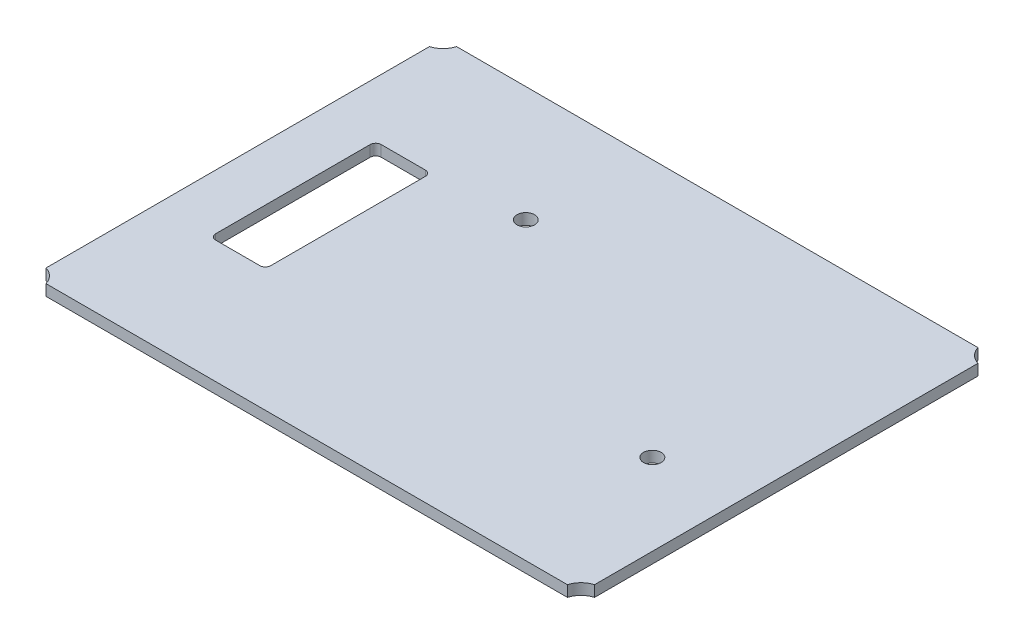
ISO-10303-21;
HEADER;
FILE_DESCRIPTION(('STEP AP214'),'2;1');
FILE_NAME('part.step','',(''),(''),'','','');
FILE_SCHEMA(('AUTOMOTIVE_DESIGN { 1 0 10303 214 1 1 1 1 }'));
ENDSEC;
DATA;
#1=APPLICATION_CONTEXT('core data for automotive mechanical design processes');
#2=APPLICATION_PROTOCOL_DEFINITION('international standard','automotive_design',2000,#1);
#3=PRODUCT_CONTEXT('',#1,'mechanical');
#4=PRODUCT('Part','Part','',(#3));
#5=PRODUCT_RELATED_PRODUCT_CATEGORY('part','',(#4));
#6=PRODUCT_DEFINITION_FORMATION('','',#4);
#7=PRODUCT_DEFINITION_CONTEXT('part definition',#1,'design');
#8=PRODUCT_DEFINITION('design','',#6,#7);
#9=PRODUCT_DEFINITION_SHAPE('','',#8);
#10=(LENGTH_UNIT() NAMED_UNIT(*) SI_UNIT(.MILLI.,.METRE.));
#11=(NAMED_UNIT(*) PLANE_ANGLE_UNIT() SI_UNIT($,.RADIAN.));
#12=(NAMED_UNIT(*) SI_UNIT($,.STERADIAN.) SOLID_ANGLE_UNIT());
#13=UNCERTAINTY_MEASURE_WITH_UNIT(LENGTH_MEASURE(1.E-05),#10,'distance_accuracy_value','');
#14=(GEOMETRIC_REPRESENTATION_CONTEXT(3) GLOBAL_UNCERTAINTY_ASSIGNED_CONTEXT((#13)) GLOBAL_UNIT_ASSIGNED_CONTEXT((#10,
#11,#12)) REPRESENTATION_CONTEXT('',''));
#15=CARTESIAN_POINT('',(0.,0.,0.));
#16=DIRECTION('',(0.,0.,1.));
#17=DIRECTION('',(1.,0.,0.));
#18=AXIS2_PLACEMENT_3D('',#15,#16,#17);
#19=CARTESIAN_POINT('',(-49.7,2.,0.));
#20=DIRECTION('',(-1.,0.,0.));
#21=DIRECTION('',(0.,0.,1.));
#22=AXIS2_PLACEMENT_3D('',#19,#20,#21);
#23=PLANE('',#22);
#24=DIRECTION('',(0.,0.,-1.));
#25=VECTOR('',#24,1.);
#26=CARTESIAN_POINT('',(-49.7,0.,0.));
#27=LINE('',#26,#25);
#28=CARTESIAN_POINT('',(-49.7,0.,34.7416767068419));
#29=VERTEX_POINT('',#28);
#30=CARTESIAN_POINT('',(-49.7,0.,-34.7416767068419));
#31=VERTEX_POINT('',#30);
#32=EDGE_CURVE('E157',#29,#31,#27,.T.);
#33=ORIENTED_EDGE('',*,*,#32,.F.);
#34=DIRECTION('',(0.,-1.,0.));
#35=VECTOR('',#34,1.);
#36=CARTESIAN_POINT('',(-49.7,2.,34.7416767068419));
#37=LINE('',#36,#35);
#38=CARTESIAN_POINT('',(-49.7,2.,34.7416767068419));
#39=VERTEX_POINT('',#38);
#40=EDGE_CURVE('E151',#39,#29,#37,.T.);
#41=ORIENTED_EDGE('',*,*,#40,.F.);
#42=DIRECTION('',(0.,0.,-1.));
#43=VECTOR('',#42,1.);
#44=CARTESIAN_POINT('',(-49.7,2.,0.));
#45=LINE('',#44,#43);
#46=CARTESIAN_POINT('',(-49.7,2.,-34.7416767068419));
#47=VERTEX_POINT('',#46);
#48=EDGE_CURVE('E154',#39,#47,#45,.T.);
#49=ORIENTED_EDGE('',*,*,#48,.T.);
#50=DIRECTION('',(0.,-1.,0.));
#51=VECTOR('',#50,1.);
#52=CARTESIAN_POINT('',(-49.7,2.,-34.7416767068419));
#53=LINE('',#52,#51);
#54=EDGE_CURVE('E196',#47,#31,#53,.T.);
#55=ORIENTED_EDGE('',*,*,#54,.T.);
#56=EDGE_LOOP('',(#33,#41,#49,#55));
#57=FACE_BOUND('',#56,.T.);
#58=ADVANCED_FACE('F37',(#57),#23,.T.);
#59=CARTESIAN_POINT('',(-50.7,2.,38.2));
#60=DIRECTION('',(0.,-1.,0.));
#61=DIRECTION('',(0.,0.,-1.));
#62=AXIS2_PLACEMENT_3D('',#59,#60,#61);
#63=CYLINDRICAL_SURFACE('',#62,3.6);
#64=CARTESIAN_POINT('',(-50.7,0.,38.2));
#65=DIRECTION('',(0.,1.,0.));
#66=DIRECTION('',(0.,0.,1.));
#67=AXIS2_PLACEMENT_3D('',#64,#65,#66);
#68=CIRCLE('',#67,3.6);
#69=CARTESIAN_POINT('',(-47.2416767068419,0.,37.2));
#70=VERTEX_POINT('',#69);
#71=EDGE_CURVE('E198',#29,#70,#68,.F.);
#72=ORIENTED_EDGE('',*,*,#71,.T.);
#73=DIRECTION('',(0.,-1.,0.));
#74=VECTOR('',#73,1.);
#75=CARTESIAN_POINT('',(-47.2416767068419,2.,37.2));
#76=LINE('',#75,#74);
#77=CARTESIAN_POINT('',(-47.2416767068419,2.,37.2));
#78=VERTEX_POINT('',#77);
#79=EDGE_CURVE('E161',#78,#70,#76,.T.);
#80=ORIENTED_EDGE('',*,*,#79,.F.);
#81=CARTESIAN_POINT('',(-50.7,2.,38.2));
#82=DIRECTION('',(0.,1.,0.));
#83=DIRECTION('',(0.,0.,1.));
#84=AXIS2_PLACEMENT_3D('',#81,#82,#83);
#85=CIRCLE('',#84,3.6);
#86=EDGE_CURVE('E164',#39,#78,#85,.F.);
#87=ORIENTED_EDGE('',*,*,#86,.F.);
#88=ORIENTED_EDGE('',*,*,#40,.T.);
#89=EDGE_LOOP('',(#72,#80,#87,#88));
#90=FACE_BOUND('',#89,.T.);
#91=ADVANCED_FACE('F165',(#90),#63,.F.);
#92=CARTESIAN_POINT('',(0.,2.,37.2));
#93=DIRECTION('',(0.,0.,-1.));
#94=DIRECTION('',(-1.,0.,0.));
#95=AXIS2_PLACEMENT_3D('',#92,#93,#94);
#96=PLANE('',#95);
#97=DIRECTION('',(1.,0.,0.));
#98=VECTOR('',#97,1.);
#99=CARTESIAN_POINT('',(0.,0.,37.2));
#100=LINE('',#99,#98);
#101=CARTESIAN_POINT('',(47.2416767068419,0.,37.2));
#102=VERTEX_POINT('',#101);
#103=EDGE_CURVE('E201',#70,#102,#100,.T.);
#104=ORIENTED_EDGE('',*,*,#103,.T.);
#105=DIRECTION('',(0.,-1.,0.));
#106=VECTOR('',#105,1.);
#107=CARTESIAN_POINT('',(47.2416767068419,2.,37.2));
#108=LINE('',#107,#106);
#109=CARTESIAN_POINT('',(47.2416767068419,2.,37.2));
#110=VERTEX_POINT('',#109);
#111=EDGE_CURVE('E224',#110,#102,#108,.T.);
#112=ORIENTED_EDGE('',*,*,#111,.F.);
#113=DIRECTION('',(1.,0.,0.));
#114=VECTOR('',#113,1.);
#115=CARTESIAN_POINT('',(0.,2.,37.2));
#116=LINE('',#115,#114);
#117=EDGE_CURVE('E169',#78,#110,#116,.T.);
#118=ORIENTED_EDGE('',*,*,#117,.F.);
#119=ORIENTED_EDGE('',*,*,#79,.T.);
#120=EDGE_LOOP('',(#104,#112,#118,#119));
#121=FACE_BOUND('',#120,.T.);
#122=ADVANCED_FACE('F339',(#121),#96,.F.);
#123=CARTESIAN_POINT('',(50.7,2.,38.2));
#124=DIRECTION('',(0.,-1.,0.));
#125=DIRECTION('',(0.,0.,-1.));
#126=AXIS2_PLACEMENT_3D('',#123,#124,#125);
#127=CYLINDRICAL_SURFACE('',#126,3.6);
#128=CARTESIAN_POINT('',(50.7,0.,38.2));
#129=DIRECTION('',(0.,1.,0.));
#130=DIRECTION('',(0.,0.,1.));
#131=AXIS2_PLACEMENT_3D('',#128,#129,#130);
#132=CIRCLE('',#131,3.6);
#133=CARTESIAN_POINT('',(49.7,0.,34.7416767068419));
#134=VERTEX_POINT('',#133);
#135=EDGE_CURVE('E204',#134,#102,#132,.T.);
#136=ORIENTED_EDGE('',*,*,#135,.F.);
#137=DIRECTION('',(0.,-1.,0.));
#138=VECTOR('',#137,1.);
#139=CARTESIAN_POINT('',(49.7,2.,34.7416767068419));
#140=LINE('',#139,#138);
#141=CARTESIAN_POINT('',(49.7,2.,34.7416767068419));
#142=VERTEX_POINT('',#141);
#143=EDGE_CURVE('E222',#142,#134,#140,.T.);
#144=ORIENTED_EDGE('',*,*,#143,.F.);
#145=CARTESIAN_POINT('',(50.7,2.,38.2));
#146=DIRECTION('',(0.,1.,0.));
#147=DIRECTION('',(0.,0.,1.));
#148=AXIS2_PLACEMENT_3D('',#145,#146,#147);
#149=CIRCLE('',#148,3.6);
#150=EDGE_CURVE('E185',#142,#110,#149,.T.);
#151=ORIENTED_EDGE('',*,*,#150,.T.);
#152=ORIENTED_EDGE('',*,*,#111,.T.);
#153=EDGE_LOOP('',(#136,#144,#151,#152));
#154=FACE_BOUND('',#153,.T.);
#155=ADVANCED_FACE('F459',(#154),#127,.F.);
#156=CARTESIAN_POINT('',(49.7,2.,0.));
#157=DIRECTION('',(-1.,0.,0.));
#158=DIRECTION('',(0.,0.,1.));
#159=AXIS2_PLACEMENT_3D('',#156,#157,#158);
#160=PLANE('',#159);
#161=DIRECTION('',(0.,0.,-1.));
#162=VECTOR('',#161,1.);
#163=CARTESIAN_POINT('',(49.7,0.,0.));
#164=LINE('',#163,#162);
#165=CARTESIAN_POINT('',(49.7,0.,-34.7416767068419));
#166=VERTEX_POINT('',#165);
#167=EDGE_CURVE('E207',#134,#166,#164,.T.);
#168=ORIENTED_EDGE('',*,*,#167,.T.);
#169=DIRECTION('',(0.,-1.,0.));
#170=VECTOR('',#169,1.);
#171=CARTESIAN_POINT('',(49.7,2.,-34.7416767068419));
#172=LINE('',#171,#170);
#173=CARTESIAN_POINT('',(49.7,2.,-34.7416767068419));
#174=VERTEX_POINT('',#173);
#175=EDGE_CURVE('E219',#174,#166,#172,.T.);
#176=ORIENTED_EDGE('',*,*,#175,.F.);
#177=DIRECTION('',(0.,0.,-1.));
#178=VECTOR('',#177,1.);
#179=CARTESIAN_POINT('',(49.7,2.,0.));
#180=LINE('',#179,#178);
#181=EDGE_CURVE('E188',#142,#174,#180,.T.);
#182=ORIENTED_EDGE('',*,*,#181,.F.);
#183=ORIENTED_EDGE('',*,*,#143,.T.);
#184=EDGE_LOOP('',(#168,#176,#182,#183));
#185=FACE_BOUND('',#184,.T.);
#186=ADVANCED_FACE('F449',(#185),#160,.F.);
#187=CARTESIAN_POINT('',(50.7,2.,-38.2));
#188=DIRECTION('',(0.,-1.,0.));
#189=DIRECTION('',(0.,0.,-1.));
#190=AXIS2_PLACEMENT_3D('',#187,#188,#189);
#191=CYLINDRICAL_SURFACE('',#190,3.6);
#192=CARTESIAN_POINT('',(50.7,0.,-38.2));
#193=DIRECTION('',(0.,1.,0.));
#194=DIRECTION('',(0.,0.,1.));
#195=AXIS2_PLACEMENT_3D('',#192,#193,#194);
#196=CIRCLE('',#195,3.6);
#197=CARTESIAN_POINT('',(47.2416767068419,0.,-37.2));
#198=VERTEX_POINT('',#197);
#199=EDGE_CURVE('E209',#166,#198,#196,.F.);
#200=ORIENTED_EDGE('',*,*,#199,.T.);
#201=DIRECTION('',(0.,-1.,0.));
#202=VECTOR('',#201,1.);
#203=CARTESIAN_POINT('',(47.2416767068419,2.,-37.2));
#204=LINE('',#203,#202);
#205=CARTESIAN_POINT('',(47.2416767068419,2.,-37.2));
#206=VERTEX_POINT('',#205);
#207=EDGE_CURVE('E217',#206,#198,#204,.T.);
#208=ORIENTED_EDGE('',*,*,#207,.F.);
#209=CARTESIAN_POINT('',(50.7,2.,-38.2));
#210=DIRECTION('',(0.,1.,0.));
#211=DIRECTION('',(0.,0.,1.));
#212=AXIS2_PLACEMENT_3D('',#209,#210,#211);
#213=CIRCLE('',#212,3.6);
#214=EDGE_CURVE('E190',#174,#206,#213,.F.);
#215=ORIENTED_EDGE('',*,*,#214,.F.);
#216=ORIENTED_EDGE('',*,*,#175,.T.);
#217=EDGE_LOOP('',(#200,#208,#215,#216));
#218=FACE_BOUND('',#217,.T.);
#219=ADVANCED_FACE('F439',(#218),#191,.F.);
#220=CARTESIAN_POINT('',(0.,2.,-37.2));
#221=DIRECTION('',(0.,0.,-1.));
#222=DIRECTION('',(-1.,0.,0.));
#223=AXIS2_PLACEMENT_3D('',#220,#221,#222);
#224=PLANE('',#223);
#225=DIRECTION('',(1.,0.,0.));
#226=VECTOR('',#225,1.);
#227=CARTESIAN_POINT('',(0.,0.,-37.2));
#228=LINE('',#227,#226);
#229=CARTESIAN_POINT('',(-47.2416767068419,0.,-37.2));
#230=VERTEX_POINT('',#229);
#231=EDGE_CURVE('E178',#230,#198,#228,.T.);
#232=ORIENTED_EDGE('',*,*,#231,.F.);
#233=DIRECTION('',(0.,-1.,0.));
#234=VECTOR('',#233,1.);
#235=CARTESIAN_POINT('',(-47.2416767068419,2.,-37.2));
#236=LINE('',#235,#234);
#237=CARTESIAN_POINT('',(-47.2416767068419,2.,-37.2));
#238=VERTEX_POINT('',#237);
#239=EDGE_CURVE('E215',#238,#230,#236,.T.);
#240=ORIENTED_EDGE('',*,*,#239,.F.);
#241=DIRECTION('',(1.,0.,0.));
#242=VECTOR('',#241,1.);
#243=CARTESIAN_POINT('',(0.,2.,-37.2));
#244=LINE('',#243,#242);
#245=EDGE_CURVE('E192',#238,#206,#244,.T.);
#246=ORIENTED_EDGE('',*,*,#245,.T.);
#247=ORIENTED_EDGE('',*,*,#207,.T.);
#248=EDGE_LOOP('',(#232,#240,#246,#247));
#249=FACE_BOUND('',#248,.T.);
#250=ADVANCED_FACE('F432',(#249),#224,.T.);
#251=CARTESIAN_POINT('',(-50.7,2.,-38.2));
#252=DIRECTION('',(0.,-1.,0.));
#253=DIRECTION('',(0.,0.,-1.));
#254=AXIS2_PLACEMENT_3D('',#251,#252,#253);
#255=CYLINDRICAL_SURFACE('',#254,3.6);
#256=CARTESIAN_POINT('',(-50.7,0.,-38.2));
#257=DIRECTION('',(0.,1.,0.));
#258=DIRECTION('',(0.,0.,1.));
#259=AXIS2_PLACEMENT_3D('',#256,#257,#258);
#260=CIRCLE('',#259,3.6);
#261=EDGE_CURVE('E175',#31,#230,#260,.T.);
#262=ORIENTED_EDGE('',*,*,#261,.F.);
#263=ORIENTED_EDGE('',*,*,#54,.F.);
#264=CARTESIAN_POINT('',(-50.7,2.,-38.2));
#265=DIRECTION('',(0.,1.,0.));
#266=DIRECTION('',(0.,0.,1.));
#267=AXIS2_PLACEMENT_3D('',#264,#265,#266);
#268=CIRCLE('',#267,3.6);
#269=EDGE_CURVE('E174',#47,#238,#268,.T.);
#270=ORIENTED_EDGE('',*,*,#269,.T.);
#271=ORIENTED_EDGE('',*,*,#239,.T.);
#272=EDGE_LOOP('',(#262,#263,#270,#271));
#273=FACE_BOUND('',#272,.T.);
#274=ADVANCED_FACE('F311',(#273),#255,.F.);
#275=CARTESIAN_POINT('',(0.,2.,0.));
#276=DIRECTION('',(0.,1.,0.));
#277=DIRECTION('',(0.,0.,1.));
#278=AXIS2_PLACEMENT_3D('',#275,#276,#277);
#279=PLANE('',#278);
#280=CARTESIAN_POINT('',(-13.7946734064446,2.,-16.2907218109704));
#281=DIRECTION('',(0.,1.,0.));
#282=DIRECTION('',(0.,0.,1.));
#283=AXIS2_PLACEMENT_3D('',#280,#281,#282);
#284=CIRCLE('',#283,1.6);
#285=CARTESIAN_POINT('',(-13.7946734064446,2.,-14.6907218109704));
#286=VERTEX_POINT('',#285);
#287=EDGE_CURVE('E297',#286,#286,#284,.T.);
#288=ORIENTED_EDGE('',*,*,#287,.F.);
#289=EDGE_LOOP('',(#288));
#290=FACE_BOUND('',#289,.T.);
#291=CARTESIAN_POINT('',(34.9733265935554,2.,9.54127818902957));
#292=DIRECTION('',(0.,1.,0.));
#293=DIRECTION('',(0.,0.,1.));
#294=AXIS2_PLACEMENT_3D('',#291,#292,#293);
#295=CIRCLE('',#294,1.59999999999999);
#296=CARTESIAN_POINT('',(34.9733265935554,2.,11.1412781890296));
#297=VERTEX_POINT('',#296);
#298=EDGE_CURVE('E298',#297,#297,#295,.T.);
#299=ORIENTED_EDGE('',*,*,#298,.F.);
#300=EDGE_LOOP('',(#299));
#301=FACE_BOUND('',#300,.T.);
#302=DIRECTION('',(0.,0.,-1.));
#303=VECTOR('',#302,1.);
#304=CARTESIAN_POINT('',(-29.7,2.,15.));
#305=LINE('',#304,#303);
#306=CARTESIAN_POINT('',(-29.7,2.,14.));
#307=VERTEX_POINT('',#306);
#308=CARTESIAN_POINT('',(-29.7,2.,-14.));
#309=VERTEX_POINT('',#308);
#310=EDGE_CURVE('E266',#307,#309,#305,.T.);
#311=ORIENTED_EDGE('',*,*,#310,.F.);
#312=CARTESIAN_POINT('',(-30.7,2.,14.));
#313=DIRECTION('',(0.,1.,0.));
#314=DIRECTION('',(0.,0.,1.));
#315=AXIS2_PLACEMENT_3D('',#312,#313,#314);
#316=CIRCLE('',#315,1.);
#317=CARTESIAN_POINT('',(-30.7,2.,15.));
#318=VERTEX_POINT('',#317);
#319=EDGE_CURVE('E245',#307,#318,#316,.F.);
#320=ORIENTED_EDGE('',*,*,#319,.T.);
#321=DIRECTION('',(1.,0.,0.));
#322=VECTOR('',#321,1.);
#323=CARTESIAN_POINT('',(-39.7,2.,15.));
#324=LINE('',#323,#322);
#325=CARTESIAN_POINT('',(-38.7,2.,15.));
#326=VERTEX_POINT('',#325);
#327=EDGE_CURVE('E181',#326,#318,#324,.T.);
#328=ORIENTED_EDGE('',*,*,#327,.F.);
#329=CARTESIAN_POINT('',(-38.7,2.,14.));
#330=DIRECTION('',(0.,1.,0.));
#331=DIRECTION('',(0.,0.,1.));
#332=AXIS2_PLACEMENT_3D('',#329,#330,#331);
#333=CIRCLE('',#332,1.);
#334=CARTESIAN_POINT('',(-39.7,2.,14.));
#335=VERTEX_POINT('',#334);
#336=EDGE_CURVE('E249',#326,#335,#333,.F.);
#337=ORIENTED_EDGE('',*,*,#336,.T.);
#338=DIRECTION('',(0.,0.,1.));
#339=VECTOR('',#338,1.);
#340=CARTESIAN_POINT('',(-39.7,2.,15.));
#341=LINE('',#340,#339);
#342=CARTESIAN_POINT('',(-39.7,2.,-14.));
#343=VERTEX_POINT('',#342);
#344=EDGE_CURVE('E261',#343,#335,#341,.T.);
#345=ORIENTED_EDGE('',*,*,#344,.F.);
#346=CARTESIAN_POINT('',(-38.7,2.,-14.));
#347=DIRECTION('',(0.,1.,0.));
#348=DIRECTION('',(0.,0.,1.));
#349=AXIS2_PLACEMENT_3D('',#346,#347,#348);
#350=CIRCLE('',#349,1.);
#351=CARTESIAN_POINT('',(-38.7,2.,-15.));
#352=VERTEX_POINT('',#351);
#353=EDGE_CURVE('E45',#343,#352,#350,.F.);
#354=ORIENTED_EDGE('',*,*,#353,.T.);
#355=DIRECTION('',(-1.,0.,0.));
#356=VECTOR('',#355,1.);
#357=CARTESIAN_POINT('',(-39.7,2.,-15.));
#358=LINE('',#357,#356);
#359=CARTESIAN_POINT('',(-30.7,2.,-15.));
#360=VERTEX_POINT('',#359);
#361=EDGE_CURVE('E259',#360,#352,#358,.T.);
#362=ORIENTED_EDGE('',*,*,#361,.F.);
#363=CARTESIAN_POINT('',(-30.7,2.,-14.));
#364=DIRECTION('',(0.,1.,0.));
#365=DIRECTION('',(0.,0.,1.));
#366=AXIS2_PLACEMENT_3D('',#363,#364,#365);
#367=CIRCLE('',#366,1.);
#368=EDGE_CURVE('E253',#360,#309,#367,.F.);
#369=ORIENTED_EDGE('',*,*,#368,.T.);
#370=EDGE_LOOP('',(#311,#320,#328,#337,#345,#354,#362,#369));
#371=FACE_BOUND('',#370,.T.);
#372=ORIENTED_EDGE('',*,*,#48,.F.);
#373=ORIENTED_EDGE('',*,*,#86,.T.);
#374=ORIENTED_EDGE('',*,*,#117,.T.);
#375=ORIENTED_EDGE('',*,*,#150,.F.);
#376=ORIENTED_EDGE('',*,*,#181,.T.);
#377=ORIENTED_EDGE('',*,*,#214,.T.);
#378=ORIENTED_EDGE('',*,*,#245,.F.);
#379=ORIENTED_EDGE('',*,*,#269,.F.);
#380=EDGE_LOOP('',(#372,#373,#374,#375,#376,#377,#378,#379));
#381=FACE_BOUND('',#380,.T.);
#382=ADVANCED_FACE('F171',(#290,#301,#371,#381),#279,.T.);
#383=CARTESIAN_POINT('',(0.,0.,0.));
#384=DIRECTION('',(0.,1.,0.));
#385=DIRECTION('',(0.,0.,1.));
#386=AXIS2_PLACEMENT_3D('',#383,#384,#385);
#387=PLANE('',#386);
#388=CARTESIAN_POINT('',(-13.7946734064446,0.,-16.2907218109704));
#389=DIRECTION('',(0.,1.,0.));
#390=DIRECTION('',(0.,0.,1.));
#391=AXIS2_PLACEMENT_3D('',#388,#389,#390);
#392=CIRCLE('',#391,1.6);
#393=CARTESIAN_POINT('',(-13.7946734064446,0.,-14.6907218109704));
#394=VERTEX_POINT('',#393);
#395=EDGE_CURVE('E287',#394,#394,#392,.F.);
#396=ORIENTED_EDGE('',*,*,#395,.F.);
#397=EDGE_LOOP('',(#396));
#398=FACE_BOUND('',#397,.T.);
#399=CARTESIAN_POINT('',(34.9733265935554,0.,9.54127818902957));
#400=DIRECTION('',(0.,1.,0.));
#401=DIRECTION('',(0.,0.,1.));
#402=AXIS2_PLACEMENT_3D('',#399,#400,#401);
#403=CIRCLE('',#402,1.59999999999999);
#404=CARTESIAN_POINT('',(34.9733265935554,0.,11.1412781890296));
#405=VERTEX_POINT('',#404);
#406=EDGE_CURVE('E294',#405,#405,#403,.F.);
#407=ORIENTED_EDGE('',*,*,#406,.F.);
#408=EDGE_LOOP('',(#407));
#409=FACE_BOUND('',#408,.T.);
#410=DIRECTION('',(0.,0.,1.));
#411=VECTOR('',#410,1.);
#412=CARTESIAN_POINT('',(-39.7,0.,15.));
#413=LINE('',#412,#411);
#414=CARTESIAN_POINT('',(-39.7,0.,-14.));
#415=VERTEX_POINT('',#414);
#416=CARTESIAN_POINT('',(-39.7,0.,14.));
#417=VERTEX_POINT('',#416);
#418=EDGE_CURVE('E273',#415,#417,#413,.T.);
#419=ORIENTED_EDGE('',*,*,#418,.T.);
#420=CARTESIAN_POINT('',(-38.7,0.,14.));
#421=DIRECTION('',(0.,1.,0.));
#422=DIRECTION('',(0.,0.,1.));
#423=AXIS2_PLACEMENT_3D('',#420,#421,#422);
#424=CIRCLE('',#423,1.);
#425=CARTESIAN_POINT('',(-38.7,0.,15.));
#426=VERTEX_POINT('',#425);
#427=EDGE_CURVE('E251',#417,#426,#424,.T.);
#428=ORIENTED_EDGE('',*,*,#427,.T.);
#429=DIRECTION('',(1.,0.,0.));
#430=VECTOR('',#429,1.);
#431=CARTESIAN_POINT('',(-39.7,0.,15.));
#432=LINE('',#431,#430);
#433=CARTESIAN_POINT('',(-30.7,0.,15.));
#434=VERTEX_POINT('',#433);
#435=EDGE_CURVE('E199',#426,#434,#432,.T.);
#436=ORIENTED_EDGE('',*,*,#435,.T.);
#437=CARTESIAN_POINT('',(-30.7,0.,14.));
#438=DIRECTION('',(0.,1.,0.));
#439=DIRECTION('',(0.,0.,1.));
#440=AXIS2_PLACEMENT_3D('',#437,#438,#439);
#441=CIRCLE('',#440,1.);
#442=CARTESIAN_POINT('',(-29.7,0.,14.));
#443=VERTEX_POINT('',#442);
#444=EDGE_CURVE('E247',#434,#443,#441,.T.);
#445=ORIENTED_EDGE('',*,*,#444,.T.);
#446=DIRECTION('',(0.,0.,-1.));
#447=VECTOR('',#446,1.);
#448=CARTESIAN_POINT('',(-29.7,0.,15.));
#449=LINE('',#448,#447);
#450=CARTESIAN_POINT('',(-29.7,0.,-14.));
#451=VERTEX_POINT('',#450);
#452=EDGE_CURVE('E282',#443,#451,#449,.T.);
#453=ORIENTED_EDGE('',*,*,#452,.T.);
#454=CARTESIAN_POINT('',(-30.7,0.,-14.));
#455=DIRECTION('',(0.,1.,0.));
#456=DIRECTION('',(0.,0.,1.));
#457=AXIS2_PLACEMENT_3D('',#454,#455,#456);
#458=CIRCLE('',#457,1.);
#459=CARTESIAN_POINT('',(-30.7,0.,-15.));
#460=VERTEX_POINT('',#459);
#461=EDGE_CURVE('E59',#451,#460,#458,.T.);
#462=ORIENTED_EDGE('',*,*,#461,.T.);
#463=DIRECTION('',(-1.,0.,0.));
#464=VECTOR('',#463,1.);
#465=CARTESIAN_POINT('',(-39.7,0.,-15.));
#466=LINE('',#465,#464);
#467=CARTESIAN_POINT('',(-38.7,0.,-15.));
#468=VERTEX_POINT('',#467);
#469=EDGE_CURVE('E275',#460,#468,#466,.T.);
#470=ORIENTED_EDGE('',*,*,#469,.T.);
#471=CARTESIAN_POINT('',(-38.7,0.,-14.));
#472=DIRECTION('',(0.,1.,0.));
#473=DIRECTION('',(0.,0.,1.));
#474=AXIS2_PLACEMENT_3D('',#471,#472,#473);
#475=CIRCLE('',#474,1.);
#476=EDGE_CURVE('E11',#468,#415,#475,.T.);
#477=ORIENTED_EDGE('',*,*,#476,.T.);
#478=EDGE_LOOP('',(#419,#428,#436,#445,#453,#462,#470,#477));
#479=FACE_BOUND('',#478,.T.);
#480=ORIENTED_EDGE('',*,*,#32,.T.);
#481=ORIENTED_EDGE('',*,*,#261,.T.);
#482=ORIENTED_EDGE('',*,*,#231,.T.);
#483=ORIENTED_EDGE('',*,*,#199,.F.);
#484=ORIENTED_EDGE('',*,*,#167,.F.);
#485=ORIENTED_EDGE('',*,*,#135,.T.);
#486=ORIENTED_EDGE('',*,*,#103,.F.);
#487=ORIENTED_EDGE('',*,*,#71,.F.);
#488=EDGE_LOOP('',(#480,#481,#482,#483,#484,#485,#486,#487));
#489=FACE_BOUND('',#488,.T.);
#490=ADVANCED_FACE('F271',(#398,#409,#479,#489),#387,.F.);
#491=CARTESIAN_POINT('',(-29.7,0.,15.));
#492=DIRECTION('',(1.,0.,0.));
#493=DIRECTION('',(0.,0.,-1.));
#494=AXIS2_PLACEMENT_3D('',#491,#492,#493);
#495=PLANE('',#494);
#496=ORIENTED_EDGE('',*,*,#452,.F.);
#497=DIRECTION('',(0.,1.,0.));
#498=VECTOR('',#497,1.);
#499=CARTESIAN_POINT('',(-29.7,2.,14.));
#500=LINE('',#499,#498);
#501=EDGE_CURVE('E228',#443,#307,#500,.T.);
#502=ORIENTED_EDGE('',*,*,#501,.T.);
#503=ORIENTED_EDGE('',*,*,#310,.T.);
#504=DIRECTION('',(0.,1.,0.));
#505=VECTOR('',#504,1.);
#506=CARTESIAN_POINT('',(-29.7,0.,-14.));
#507=LINE('',#506,#505);
#508=EDGE_CURVE('E160',#309,#451,#507,.F.);
#509=ORIENTED_EDGE('',*,*,#508,.T.);
#510=EDGE_LOOP('',(#496,#502,#503,#509));
#511=FACE_BOUND('',#510,.T.);
#512=ADVANCED_FACE('F322',(#511),#495,.F.);
#513=CARTESIAN_POINT('',(-39.7,0.,15.));
#514=DIRECTION('',(0.,0.,1.));
#515=DIRECTION('',(1.,0.,0.));
#516=AXIS2_PLACEMENT_3D('',#513,#514,#515);
#517=PLANE('',#516);
#518=ORIENTED_EDGE('',*,*,#327,.T.);
#519=DIRECTION('',(0.,1.,0.));
#520=VECTOR('',#519,1.);
#521=CARTESIAN_POINT('',(-30.7,0.,15.));
#522=LINE('',#521,#520);
#523=EDGE_CURVE('E234',#318,#434,#522,.F.);
#524=ORIENTED_EDGE('',*,*,#523,.T.);
#525=ORIENTED_EDGE('',*,*,#435,.F.);
#526=DIRECTION('',(0.,1.,0.));
#527=VECTOR('',#526,1.);
#528=CARTESIAN_POINT('',(-38.7,2.,15.));
#529=LINE('',#528,#527);
#530=EDGE_CURVE('E231',#426,#326,#529,.T.);
#531=ORIENTED_EDGE('',*,*,#530,.T.);
#532=EDGE_LOOP('',(#518,#524,#525,#531));
#533=FACE_BOUND('',#532,.T.);
#534=ADVANCED_FACE('F329',(#533),#517,.F.);
#535=CARTESIAN_POINT('',(-39.7,0.,15.));
#536=DIRECTION('',(-1.,0.,0.));
#537=DIRECTION('',(0.,0.,1.));
#538=AXIS2_PLACEMENT_3D('',#535,#536,#537);
#539=PLANE('',#538);
#540=ORIENTED_EDGE('',*,*,#344,.T.);
#541=DIRECTION('',(0.,1.,0.));
#542=VECTOR('',#541,1.);
#543=CARTESIAN_POINT('',(-39.7,0.,14.));
#544=LINE('',#543,#542);
#545=EDGE_CURVE('E239',#335,#417,#544,.F.);
#546=ORIENTED_EDGE('',*,*,#545,.T.);
#547=ORIENTED_EDGE('',*,*,#418,.F.);
#548=DIRECTION('',(0.,1.,0.));
#549=VECTOR('',#548,1.);
#550=CARTESIAN_POINT('',(-39.7,2.,-14.));
#551=LINE('',#550,#549);
#552=EDGE_CURVE('E236',#415,#343,#551,.T.);
#553=ORIENTED_EDGE('',*,*,#552,.T.);
#554=EDGE_LOOP('',(#540,#546,#547,#553));
#555=FACE_BOUND('',#554,.T.);
#556=ADVANCED_FACE('F277',(#555),#539,.F.);
#557=CARTESIAN_POINT('',(-39.7,0.,-15.));
#558=DIRECTION('',(0.,0.,-1.));
#559=DIRECTION('',(-1.,0.,0.));
#560=AXIS2_PLACEMENT_3D('',#557,#558,#559);
#561=PLANE('',#560);
#562=ORIENTED_EDGE('',*,*,#469,.F.);
#563=DIRECTION('',(0.,1.,0.));
#564=VECTOR('',#563,1.);
#565=CARTESIAN_POINT('',(-30.7,2.,-15.));
#566=LINE('',#565,#564);
#567=EDGE_CURVE('E242',#460,#360,#566,.T.);
#568=ORIENTED_EDGE('',*,*,#567,.T.);
#569=ORIENTED_EDGE('',*,*,#361,.T.);
#570=DIRECTION('',(0.,1.,0.));
#571=VECTOR('',#570,1.);
#572=CARTESIAN_POINT('',(-38.7,0.,-15.));
#573=LINE('',#572,#571);
#574=EDGE_CURVE('E52',#352,#468,#573,.F.);
#575=ORIENTED_EDGE('',*,*,#574,.T.);
#576=EDGE_LOOP('',(#562,#568,#569,#575));
#577=FACE_BOUND('',#576,.T.);
#578=ADVANCED_FACE('F264',(#577),#561,.F.);
#579=CARTESIAN_POINT('',(-30.7,0.,14.));
#580=DIRECTION('',(0.,-1.,0.));
#581=DIRECTION('',(0.,0.,-1.));
#582=AXIS2_PLACEMENT_3D('',#579,#580,#581);
#583=CYLINDRICAL_SURFACE('',#582,1.);
#584=ORIENTED_EDGE('',*,*,#444,.F.);
#585=ORIENTED_EDGE('',*,*,#523,.F.);
#586=ORIENTED_EDGE('',*,*,#319,.F.);
#587=ORIENTED_EDGE('',*,*,#501,.F.);
#588=EDGE_LOOP('',(#584,#585,#586,#587));
#589=FACE_BOUND('',#588,.T.);
#590=ADVANCED_FACE('F343',(#589),#583,.F.);
#591=CARTESIAN_POINT('',(-38.7,0.,14.));
#592=DIRECTION('',(0.,-1.,0.));
#593=DIRECTION('',(0.,0.,-1.));
#594=AXIS2_PLACEMENT_3D('',#591,#592,#593);
#595=CYLINDRICAL_SURFACE('',#594,1.);
#596=ORIENTED_EDGE('',*,*,#427,.F.);
#597=ORIENTED_EDGE('',*,*,#545,.F.);
#598=ORIENTED_EDGE('',*,*,#336,.F.);
#599=ORIENTED_EDGE('',*,*,#530,.F.);
#600=EDGE_LOOP('',(#596,#597,#598,#599));
#601=FACE_BOUND('',#600,.T.);
#602=ADVANCED_FACE('F346',(#601),#595,.F.);
#603=CARTESIAN_POINT('',(-30.7,0.,-14.));
#604=DIRECTION('',(0.,-1.,0.));
#605=DIRECTION('',(0.,0.,-1.));
#606=AXIS2_PLACEMENT_3D('',#603,#604,#605);
#607=CYLINDRICAL_SURFACE('',#606,1.);
#608=ORIENTED_EDGE('',*,*,#461,.F.);
#609=ORIENTED_EDGE('',*,*,#508,.F.);
#610=ORIENTED_EDGE('',*,*,#368,.F.);
#611=ORIENTED_EDGE('',*,*,#567,.F.);
#612=EDGE_LOOP('',(#608,#609,#610,#611));
#613=FACE_BOUND('',#612,.T.);
#614=ADVANCED_FACE('F349',(#613),#607,.F.);
#615=CARTESIAN_POINT('',(-38.7,0.,-14.));
#616=DIRECTION('',(0.,-1.,0.));
#617=DIRECTION('',(0.,0.,-1.));
#618=AXIS2_PLACEMENT_3D('',#615,#616,#617);
#619=CYLINDRICAL_SURFACE('',#618,1.);
#620=ORIENTED_EDGE('',*,*,#476,.F.);
#621=ORIENTED_EDGE('',*,*,#574,.F.);
#622=ORIENTED_EDGE('',*,*,#353,.F.);
#623=ORIENTED_EDGE('',*,*,#552,.F.);
#624=EDGE_LOOP('',(#620,#621,#622,#623));
#625=FACE_BOUND('',#624,.T.);
#626=ADVANCED_FACE('F39',(#625),#619,.F.);
#627=CARTESIAN_POINT('',(34.9733265935554,-0.00100000000000013,9.54127818902957));
#628=DIRECTION('',(0.,1.,0.));
#629=DIRECTION('',(0.,0.,1.));
#630=AXIS2_PLACEMENT_3D('',#627,#628,#629);
#631=CYLINDRICAL_SURFACE('',#630,1.59999999999999);
#632=ORIENTED_EDGE('',*,*,#298,.T.);
#633=EDGE_LOOP('',(#632));
#634=FACE_BOUND('',#633,.T.);
#635=ORIENTED_EDGE('',*,*,#406,.T.);
#636=EDGE_LOOP('',(#635));
#637=FACE_BOUND('',#636,.T.);
#638=ADVANCED_FACE('F315',(#634,#637),#631,.F.);
#639=CARTESIAN_POINT('',(-13.7946734064446,-0.00100000000000013,-16.2907218109704));
#640=DIRECTION('',(0.,1.,0.));
#641=DIRECTION('',(0.,0.,1.));
#642=AXIS2_PLACEMENT_3D('',#639,#640,#641);
#643=CYLINDRICAL_SURFACE('',#642,1.6);
#644=ORIENTED_EDGE('',*,*,#287,.T.);
#645=EDGE_LOOP('',(#644));
#646=FACE_BOUND('',#645,.T.);
#647=ORIENTED_EDGE('',*,*,#395,.T.);
#648=EDGE_LOOP('',(#647));
#649=FACE_BOUND('',#648,.T.);
#650=ADVANCED_FACE('F306',(#646,#649),#643,.F.);
#651=CLOSED_SHELL('',(#58,#91,#122,#155,#186,#219,#250,#274,#382,#490,#512,#534,#556,#578,#590,
#602,#614,#626,#638,#650));
#652=MANIFOLD_SOLID_BREP('B2',#651);
#653=ADVANCED_BREP_SHAPE_REPRESENTATION('',(#18,#652),#14);
#654=SHAPE_DEFINITION_REPRESENTATION(#9,#653);
ENDSEC;
END-ISO-10303-21;
